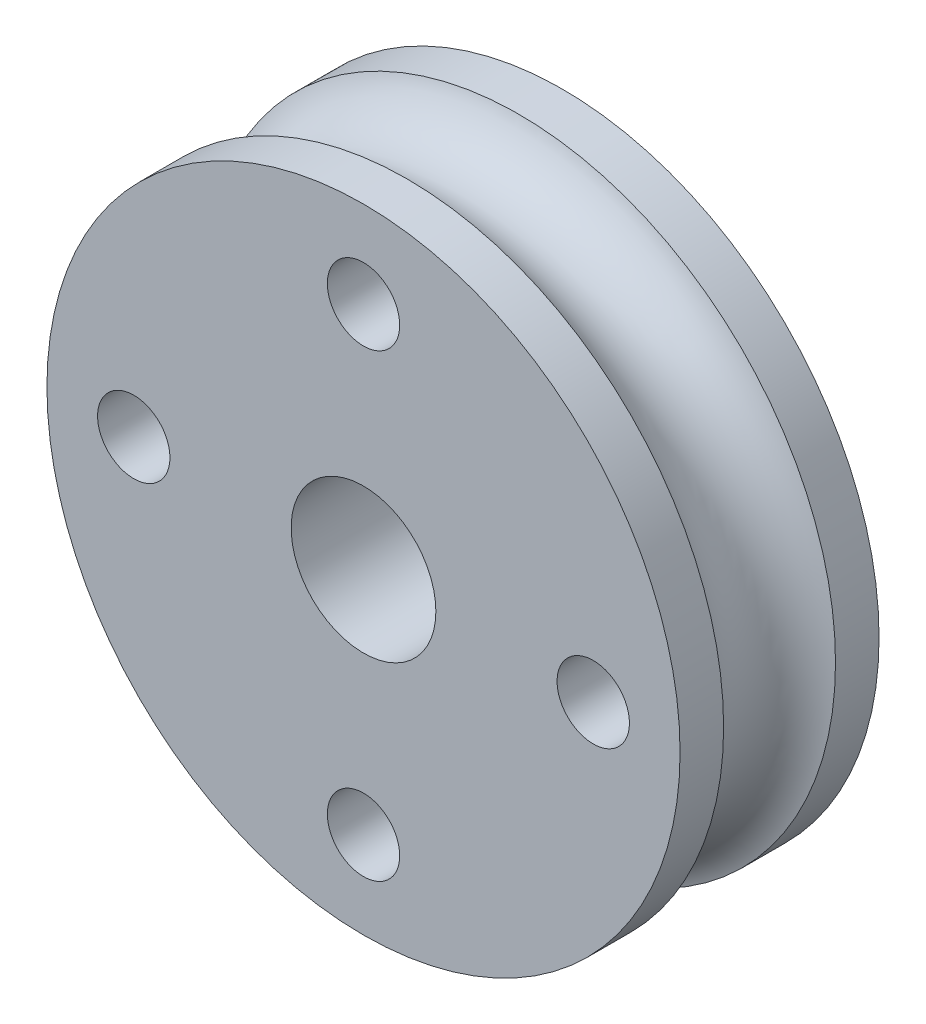
ISO-10303-21;
HEADER;
FILE_DESCRIPTION(('STEP AP214'),'2;1');
FILE_NAME('part.step','',(''),(''),'','','');
FILE_SCHEMA(('AUTOMOTIVE_DESIGN { 1 0 10303 214 1 1 1 1 }'));
ENDSEC;
DATA;
#1=APPLICATION_CONTEXT('core data for automotive mechanical design processes');
#2=APPLICATION_PROTOCOL_DEFINITION('international standard','automotive_design',2000,#1);
#3=PRODUCT_CONTEXT('',#1,'mechanical');
#4=PRODUCT('Part','Part','',(#3));
#5=PRODUCT_RELATED_PRODUCT_CATEGORY('part','',(#4));
#6=PRODUCT_DEFINITION_FORMATION('','',#4);
#7=PRODUCT_DEFINITION_CONTEXT('part definition',#1,'design');
#8=PRODUCT_DEFINITION('design','',#6,#7);
#9=PRODUCT_DEFINITION_SHAPE('','',#8);
#10=(LENGTH_UNIT() NAMED_UNIT(*) SI_UNIT(.MILLI.,.METRE.));
#11=(NAMED_UNIT(*) PLANE_ANGLE_UNIT() SI_UNIT($,.RADIAN.));
#12=(NAMED_UNIT(*) SI_UNIT($,.STERADIAN.) SOLID_ANGLE_UNIT());
#13=UNCERTAINTY_MEASURE_WITH_UNIT(LENGTH_MEASURE(1.E-05),#10,'distance_accuracy_value','');
#14=(GEOMETRIC_REPRESENTATION_CONTEXT(3) GLOBAL_UNCERTAINTY_ASSIGNED_CONTEXT((#13)) GLOBAL_UNIT_ASSIGNED_CONTEXT((#10,
#11,#12)) REPRESENTATION_CONTEXT('',''));
#15=CARTESIAN_POINT('',(0.,0.,0.));
#16=DIRECTION('',(0.,0.,1.));
#17=DIRECTION('',(1.,0.,0.));
#18=AXIS2_PLACEMENT_3D('',#15,#16,#17);
#19=CARTESIAN_POINT('',(0.,0.,5.5));
#20=DIRECTION('',(0.,0.,-1.));
#21=DIRECTION('',(-1.,0.,0.));
#22=AXIS2_PLACEMENT_3D('',#19,#20,#21);
#23=CYLINDRICAL_SURFACE('',#22,17.5);
#24=CARTESIAN_POINT('',(0.,0.,5.5));
#25=DIRECTION('',(0.,0.,1.));
#26=DIRECTION('',(1.,0.,0.));
#27=AXIS2_PLACEMENT_3D('',#24,#25,#26);
#28=CIRCLE('',#27,17.5);
#29=CARTESIAN_POINT('',(17.5,0.,5.5));
#30=VERTEX_POINT('',#29);
#31=EDGE_CURVE('E10',#30,#30,#28,.T.);
#32=ORIENTED_EDGE('',*,*,#31,.F.);
#33=EDGE_LOOP('',(#32));
#34=FACE_BOUND('',#33,.T.);
#35=CARTESIAN_POINT('',(0.,0.,3.09232921921325));
#36=DIRECTION('',(0.,0.,-1.));
#37=DIRECTION('',(-1.,0.,0.));
#38=AXIS2_PLACEMENT_3D('',#35,#36,#37);
#39=CIRCLE('',#38,17.5);
#40=CARTESIAN_POINT('',(-17.5,0.,3.09232921921325));
#41=VERTEX_POINT('',#40);
#42=EDGE_CURVE('E35',#41,#41,#39,.T.);
#43=ORIENTED_EDGE('',*,*,#42,.F.);
#44=EDGE_LOOP('',(#43));
#45=FACE_BOUND('',#44,.T.);
#46=ADVANCED_FACE('F32',(#34,#45),#23,.T.);
#47=CARTESIAN_POINT('',(0.,0.,5.5));
#48=DIRECTION('',(0.,0.,1.));
#49=DIRECTION('',(1.,0.,0.));
#50=AXIS2_PLACEMENT_3D('',#47,#48,#49);
#51=PLANE('',#50);
#52=CARTESIAN_POINT('',(0.,12.7,5.5));
#53=DIRECTION('',(0.,0.,1.));
#54=DIRECTION('',(1.,0.,0.));
#55=AXIS2_PLACEMENT_3D('',#52,#53,#54);
#56=CIRCLE('',#55,2.);
#57=CARTESIAN_POINT('',(2.,12.7,5.5));
#58=VERTEX_POINT('',#57);
#59=EDGE_CURVE('E82',#58,#58,#56,.T.);
#60=ORIENTED_EDGE('',*,*,#59,.F.);
#61=EDGE_LOOP('',(#60));
#62=FACE_BOUND('',#61,.T.);
#63=CARTESIAN_POINT('',(12.7,0.,5.5));
#64=DIRECTION('',(0.,0.,1.));
#65=DIRECTION('',(1.,0.,0.));
#66=AXIS2_PLACEMENT_3D('',#63,#64,#65);
#67=CIRCLE('',#66,2.);
#68=CARTESIAN_POINT('',(14.7,0.,5.5));
#69=VERTEX_POINT('',#68);
#70=EDGE_CURVE('E76',#69,#69,#67,.T.);
#71=ORIENTED_EDGE('',*,*,#70,.F.);
#72=EDGE_LOOP('',(#71));
#73=FACE_BOUND('',#72,.T.);
#74=CARTESIAN_POINT('',(0.,-12.7,5.5));
#75=DIRECTION('',(0.,0.,1.));
#76=DIRECTION('',(1.,0.,0.));
#77=AXIS2_PLACEMENT_3D('',#74,#75,#76);
#78=CIRCLE('',#77,2.);
#79=CARTESIAN_POINT('',(2.,-12.7,5.5));
#80=VERTEX_POINT('',#79);
#81=EDGE_CURVE('E70',#80,#80,#78,.T.);
#82=ORIENTED_EDGE('',*,*,#81,.F.);
#83=EDGE_LOOP('',(#82));
#84=FACE_BOUND('',#83,.T.);
#85=CARTESIAN_POINT('',(-12.7,0.,5.5));
#86=DIRECTION('',(0.,0.,1.));
#87=DIRECTION('',(1.,0.,0.));
#88=AXIS2_PLACEMENT_3D('',#85,#86,#87);
#89=CIRCLE('',#88,2.);
#90=CARTESIAN_POINT('',(-10.7,0.,5.5));
#91=VERTEX_POINT('',#90);
#92=EDGE_CURVE('E62',#91,#91,#89,.T.);
#93=ORIENTED_EDGE('',*,*,#92,.F.);
#94=EDGE_LOOP('',(#93));
#95=FACE_BOUND('',#94,.T.);
#96=CARTESIAN_POINT('',(0.,0.,5.5));
#97=DIRECTION('',(0.,0.,1.));
#98=DIRECTION('',(1.,0.,0.));
#99=AXIS2_PLACEMENT_3D('',#96,#97,#98);
#100=CIRCLE('',#99,4.);
#101=CARTESIAN_POINT('',(4.,0.,5.5));
#102=VERTEX_POINT('',#101);
#103=EDGE_CURVE('E54',#102,#102,#100,.T.);
#104=ORIENTED_EDGE('',*,*,#103,.F.);
#105=EDGE_LOOP('',(#104));
#106=FACE_BOUND('',#105,.T.);
#107=ORIENTED_EDGE('',*,*,#31,.T.);
#108=EDGE_LOOP('',(#107));
#109=FACE_BOUND('',#108,.T.);
#110=ADVANCED_FACE('F88',(#62,#73,#84,#95,#106,#109),#51,.T.);
#111=CARTESIAN_POINT('',(0.,0.,0.));
#112=DIRECTION('',(0.,0.,1.));
#113=DIRECTION('',(1.,0.,0.));
#114=AXIS2_PLACEMENT_3D('',#111,#112,#113);
#115=TOROIDAL_SURFACE('',#114,18.5,3.25);
#116=CARTESIAN_POINT('',(0.,0.,-3.09232921921325));
#117=DIRECTION('',(0.,0.,1.));
#118=DIRECTION('',(1.,0.,0.));
#119=AXIS2_PLACEMENT_3D('',#116,#117,#118);
#120=CIRCLE('',#119,17.5);
#121=CARTESIAN_POINT('',(17.5,0.,-3.09232921921325));
#122=VERTEX_POINT('',#121);
#123=EDGE_CURVE('E48',#122,#122,#120,.T.);
#124=ORIENTED_EDGE('',*,*,#123,.T.);
#125=EDGE_LOOP('',(#124));
#126=FACE_BOUND('',#125,.T.);
#127=ORIENTED_EDGE('',*,*,#42,.T.);
#128=EDGE_LOOP('',(#127));
#129=FACE_BOUND('',#128,.T.);
#130=ADVANCED_FACE('F91',(#126,#129),#115,.F.);
#131=CARTESIAN_POINT('',(0.,0.,-5.5));
#132=DIRECTION('',(0.,0.,1.));
#133=DIRECTION('',(1.,0.,0.));
#134=AXIS2_PLACEMENT_3D('',#131,#132,#133);
#135=PLANE('',#134);
#136=CARTESIAN_POINT('',(0.,12.7,-5.5));
#137=DIRECTION('',(0.,0.,1.));
#138=DIRECTION('',(1.,0.,0.));
#139=AXIS2_PLACEMENT_3D('',#136,#137,#138);
#140=CIRCLE('',#139,2.);
#141=CARTESIAN_POINT('',(2.,12.7,-5.5));
#142=VERTEX_POINT('',#141);
#143=EDGE_CURVE('E79',#142,#142,#140,.T.);
#144=ORIENTED_EDGE('',*,*,#143,.T.);
#145=EDGE_LOOP('',(#144));
#146=FACE_BOUND('',#145,.T.);
#147=CARTESIAN_POINT('',(12.7,0.,-5.5));
#148=DIRECTION('',(0.,0.,1.));
#149=DIRECTION('',(1.,0.,0.));
#150=AXIS2_PLACEMENT_3D('',#147,#148,#149);
#151=CIRCLE('',#150,2.);
#152=CARTESIAN_POINT('',(14.7,0.,-5.5));
#153=VERTEX_POINT('',#152);
#154=EDGE_CURVE('E73',#153,#153,#151,.T.);
#155=ORIENTED_EDGE('',*,*,#154,.T.);
#156=EDGE_LOOP('',(#155));
#157=FACE_BOUND('',#156,.T.);
#158=CARTESIAN_POINT('',(0.,-12.7,-5.5));
#159=DIRECTION('',(0.,0.,1.));
#160=DIRECTION('',(1.,0.,0.));
#161=AXIS2_PLACEMENT_3D('',#158,#159,#160);
#162=CIRCLE('',#161,2.);
#163=CARTESIAN_POINT('',(2.,-12.7,-5.5));
#164=VERTEX_POINT('',#163);
#165=EDGE_CURVE('E67',#164,#164,#162,.T.);
#166=ORIENTED_EDGE('',*,*,#165,.T.);
#167=EDGE_LOOP('',(#166));
#168=FACE_BOUND('',#167,.T.);
#169=CARTESIAN_POINT('',(-12.7,0.,-5.5));
#170=DIRECTION('',(0.,0.,1.));
#171=DIRECTION('',(1.,0.,0.));
#172=AXIS2_PLACEMENT_3D('',#169,#170,#171);
#173=CIRCLE('',#172,2.);
#174=CARTESIAN_POINT('',(-10.7,0.,-5.5));
#175=VERTEX_POINT('',#174);
#176=EDGE_CURVE('E58',#175,#175,#173,.T.);
#177=ORIENTED_EDGE('',*,*,#176,.T.);
#178=EDGE_LOOP('',(#177));
#179=FACE_BOUND('',#178,.T.);
#180=CARTESIAN_POINT('',(0.,0.,-5.5));
#181=DIRECTION('',(0.,0.,1.));
#182=DIRECTION('',(1.,0.,0.));
#183=AXIS2_PLACEMENT_3D('',#180,#181,#182);
#184=CIRCLE('',#183,4.);
#185=CARTESIAN_POINT('',(4.,0.,-5.5));
#186=VERTEX_POINT('',#185);
#187=EDGE_CURVE('E46',#186,#186,#184,.T.);
#188=ORIENTED_EDGE('',*,*,#187,.T.);
#189=EDGE_LOOP('',(#188));
#190=FACE_BOUND('',#189,.T.);
#191=CARTESIAN_POINT('',(0.,0.,-5.5));
#192=DIRECTION('',(0.,0.,1.));
#193=DIRECTION('',(1.,0.,0.));
#194=AXIS2_PLACEMENT_3D('',#191,#192,#193);
#195=CIRCLE('',#194,17.5);
#196=CARTESIAN_POINT('',(17.5,0.,-5.5));
#197=VERTEX_POINT('',#196);
#198=EDGE_CURVE('E39',#197,#197,#195,.T.);
#199=ORIENTED_EDGE('',*,*,#198,.F.);
#200=EDGE_LOOP('',(#199));
#201=FACE_BOUND('',#200,.T.);
#202=ADVANCED_FACE('F123',(#146,#157,#168,#179,#190,#201),#135,.F.);
#203=ORIENTED_EDGE('',*,*,#198,.T.);
#204=EDGE_LOOP('',(#203));
#205=FACE_BOUND('',#204,.T.);
#206=ORIENTED_EDGE('',*,*,#123,.F.);
#207=EDGE_LOOP('',(#206));
#208=FACE_BOUND('',#207,.T.);
#209=ADVANCED_FACE('F113',(#205,#208),#23,.T.);
#210=CARTESIAN_POINT('',(0.,0.,5.5));
#211=DIRECTION('',(0.,0.,1.));
#212=DIRECTION('',(1.,0.,0.));
#213=AXIS2_PLACEMENT_3D('',#210,#211,#212);
#214=CYLINDRICAL_SURFACE('',#213,4.);
#215=ORIENTED_EDGE('',*,*,#187,.F.);
#216=EDGE_LOOP('',(#215));
#217=FACE_BOUND('',#216,.T.);
#218=ORIENTED_EDGE('',*,*,#103,.T.);
#219=EDGE_LOOP('',(#218));
#220=FACE_BOUND('',#219,.T.);
#221=ADVANCED_FACE('F103',(#217,#220),#214,.F.);
#222=CARTESIAN_POINT('',(-12.7,0.,5.5));
#223=DIRECTION('',(0.,0.,1.));
#224=DIRECTION('',(1.,0.,0.));
#225=AXIS2_PLACEMENT_3D('',#222,#223,#224);
#226=CYLINDRICAL_SURFACE('',#225,2.);
#227=ORIENTED_EDGE('',*,*,#176,.F.);
#228=EDGE_LOOP('',(#227));
#229=FACE_BOUND('',#228,.T.);
#230=ORIENTED_EDGE('',*,*,#92,.T.);
#231=EDGE_LOOP('',(#230));
#232=FACE_BOUND('',#231,.T.);
#233=ADVANCED_FACE('F100',(#229,#232),#226,.F.);
#234=CARTESIAN_POINT('',(0.,-12.7,5.5));
#235=DIRECTION('',(0.,0.,1.));
#236=DIRECTION('',(1.,0.,0.));
#237=AXIS2_PLACEMENT_3D('',#234,#235,#236);
#238=CYLINDRICAL_SURFACE('',#237,2.);
#239=ORIENTED_EDGE('',*,*,#165,.F.);
#240=EDGE_LOOP('',(#239));
#241=FACE_BOUND('',#240,.T.);
#242=ORIENTED_EDGE('',*,*,#81,.T.);
#243=EDGE_LOOP('',(#242));
#244=FACE_BOUND('',#243,.T.);
#245=ADVANCED_FACE('F102',(#241,#244),#238,.F.);
#246=CARTESIAN_POINT('',(12.7,0.,5.5));
#247=DIRECTION('',(0.,0.,1.));
#248=DIRECTION('',(1.,0.,0.));
#249=AXIS2_PLACEMENT_3D('',#246,#247,#248);
#250=CYLINDRICAL_SURFACE('',#249,2.);
#251=ORIENTED_EDGE('',*,*,#154,.F.);
#252=EDGE_LOOP('',(#251));
#253=FACE_BOUND('',#252,.T.);
#254=ORIENTED_EDGE('',*,*,#70,.T.);
#255=EDGE_LOOP('',(#254));
#256=FACE_BOUND('',#255,.T.);
#257=ADVANCED_FACE('F110',(#253,#256),#250,.F.);
#258=CARTESIAN_POINT('',(0.,12.7,5.5));
#259=DIRECTION('',(0.,0.,1.));
#260=DIRECTION('',(1.,0.,0.));
#261=AXIS2_PLACEMENT_3D('',#258,#259,#260);
#262=CYLINDRICAL_SURFACE('',#261,2.);
#263=ORIENTED_EDGE('',*,*,#143,.F.);
#264=EDGE_LOOP('',(#263));
#265=FACE_BOUND('',#264,.T.);
#266=ORIENTED_EDGE('',*,*,#59,.T.);
#267=EDGE_LOOP('',(#266));
#268=FACE_BOUND('',#267,.T.);
#269=ADVANCED_FACE('F86',(#265,#268),#262,.F.);
#270=CLOSED_SHELL('',(#46,#110,#130,#202,#209,#221,#233,#245,#257,#269));
#271=MANIFOLD_SOLID_BREP('B2',#270);
#272=ADVANCED_BREP_SHAPE_REPRESENTATION('',(#18,#271),#14);
#273=SHAPE_DEFINITION_REPRESENTATION(#9,#272);
ENDSEC;
END-ISO-10303-21;
